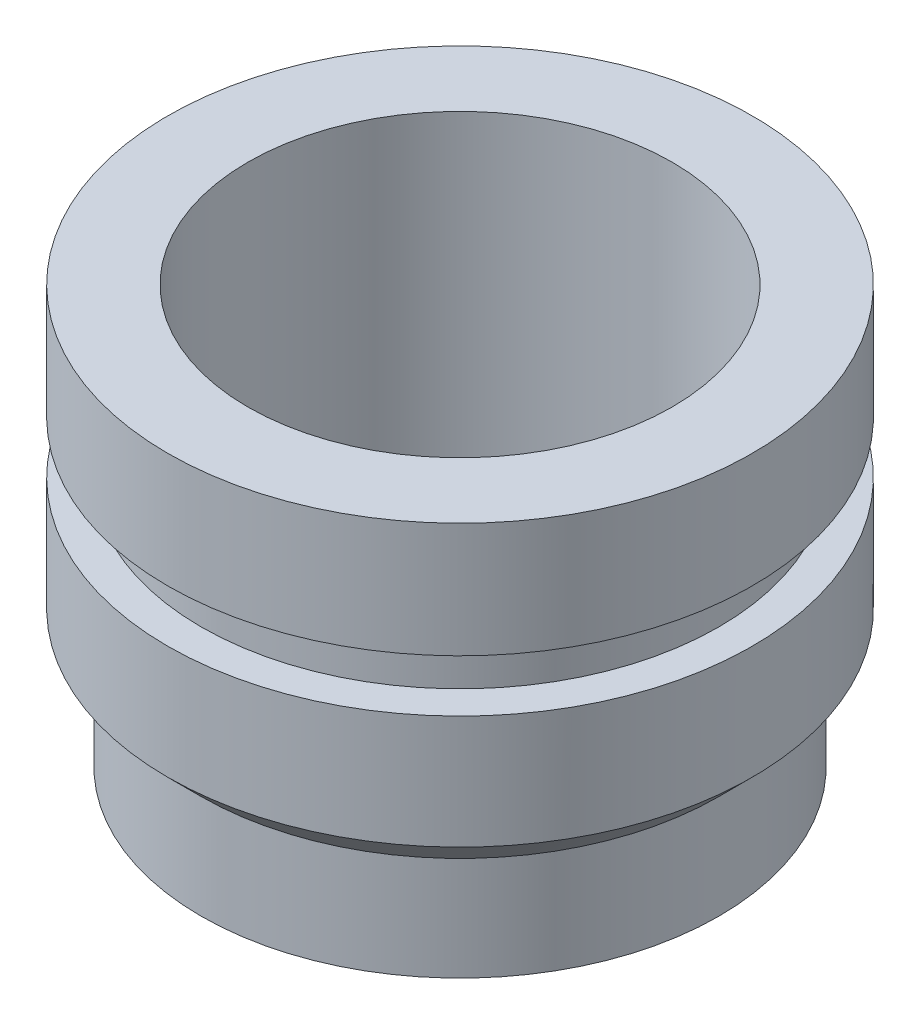
ISO-10303-21;
HEADER;
FILE_DESCRIPTION(('STEP AP214'),'2;1');
FILE_NAME('part.step','',(''),(''),'','','');
FILE_SCHEMA(('AUTOMOTIVE_DESIGN { 1 0 10303 214 1 1 1 1 }'));
ENDSEC;
DATA;
#1=APPLICATION_CONTEXT('core data for automotive mechanical design processes');
#2=APPLICATION_PROTOCOL_DEFINITION('international standard','automotive_design',2000,#1);
#3=PRODUCT_CONTEXT('',#1,'mechanical');
#4=PRODUCT('Part','Part','',(#3));
#5=PRODUCT_RELATED_PRODUCT_CATEGORY('part','',(#4));
#6=PRODUCT_DEFINITION_FORMATION('','',#4);
#7=PRODUCT_DEFINITION_CONTEXT('part definition',#1,'design');
#8=PRODUCT_DEFINITION('design','',#6,#7);
#9=PRODUCT_DEFINITION_SHAPE('','',#8);
#10=(LENGTH_UNIT() NAMED_UNIT(*) SI_UNIT(.MILLI.,.METRE.));
#11=(NAMED_UNIT(*) PLANE_ANGLE_UNIT() SI_UNIT($,.RADIAN.));
#12=(NAMED_UNIT(*) SI_UNIT($,.STERADIAN.) SOLID_ANGLE_UNIT());
#13=UNCERTAINTY_MEASURE_WITH_UNIT(LENGTH_MEASURE(1.E-05),#10,'distance_accuracy_value','');
#14=(GEOMETRIC_REPRESENTATION_CONTEXT(3) GLOBAL_UNCERTAINTY_ASSIGNED_CONTEXT((#13)) GLOBAL_UNIT_ASSIGNED_CONTEXT((#10,
#11,#12)) REPRESENTATION_CONTEXT('',''));
#15=CARTESIAN_POINT('',(0.,0.,0.));
#16=DIRECTION('',(0.,0.,1.));
#17=DIRECTION('',(1.,0.,0.));
#18=AXIS2_PLACEMENT_3D('',#15,#16,#17);
#19=CARTESIAN_POINT('',(0.,-2.50000008,0.));
#20=DIRECTION('',(0.,1.,0.));
#21=DIRECTION('',(0.,0.,1.));
#22=AXIS2_PLACEMENT_3D('',#19,#20,#21);
#23=CYLINDRICAL_SURFACE('',#22,1.750000056);
#24=CARTESIAN_POINT('',(0.,-1.67950007,0.));
#25=DIRECTION('',(0.,-1.,0.));
#26=DIRECTION('',(0.,0.,-1.));
#27=AXIS2_PLACEMENT_3D('',#24,#25,#26);
#28=CIRCLE('',#27,1.750000056);
#29=CARTESIAN_POINT('',(0.,-1.67950007,-1.750000056));
#30=VERTEX_POINT('',#29);
#31=EDGE_CURVE('E54',#30,#30,#28,.F.);
#32=ORIENTED_EDGE('',*,*,#31,.T.);
#33=EDGE_LOOP('',(#32));
#34=FACE_BOUND('',#33,.T.);
#35=CARTESIAN_POINT('',(0.,-1.000000032,0.));
#36=DIRECTION('',(0.,1.,0.));
#37=DIRECTION('',(0.,0.,1.));
#38=AXIS2_PLACEMENT_3D('',#35,#36,#37);
#39=CIRCLE('',#38,1.750000056);
#40=CARTESIAN_POINT('',(0.,-1.000000032,1.750000056));
#41=VERTEX_POINT('',#40);
#42=EDGE_CURVE('E79',#41,#41,#39,.T.);
#43=ORIENTED_EDGE('',*,*,#42,.F.);
#44=EDGE_LOOP('',(#43));
#45=FACE_BOUND('',#44,.T.);
#46=ADVANCED_FACE('F45',(#34,#45),#23,.T.);
#47=CARTESIAN_POINT('',(0.,-0.687500022,0.));
#48=DIRECTION('',(0.,1.,0.));
#49=DIRECTION('',(0.,0.,1.));
#50=AXIS2_PLACEMENT_3D('',#47,#48,#49);
#51=CIRCLE('',#50,1.750000056);
#52=CARTESIAN_POINT('',(0.,-0.687500022,1.750000056));
#53=VERTEX_POINT('',#52);
#54=EDGE_CURVE('E78',#53,#53,#51,.T.);
#55=ORIENTED_EDGE('',*,*,#54,.T.);
#56=EDGE_LOOP('',(#55));
#57=FACE_BOUND('',#56,.T.);
#58=CARTESIAN_POINT('',(0.,0.,0.));
#59=DIRECTION('',(0.,1.,0.));
#60=DIRECTION('',(0.,0.,1.));
#61=AXIS2_PLACEMENT_3D('',#58,#59,#60);
#62=CIRCLE('',#61,1.750000056);
#63=CARTESIAN_POINT('',(0.,0.,1.750000056));
#64=VERTEX_POINT('',#63);
#65=EDGE_CURVE('E59',#64,#64,#62,.T.);
#66=ORIENTED_EDGE('',*,*,#65,.F.);
#67=EDGE_LOOP('',(#66));
#68=FACE_BOUND('',#67,.T.);
#69=ADVANCED_FACE('F114',(#57,#68),#23,.T.);
#70=CARTESIAN_POINT('',(0.,-2.50000008,0.));
#71=DIRECTION('',(0.,1.,0.));
#72=DIRECTION('',(0.,0.,1.));
#73=AXIS2_PLACEMENT_3D('',#70,#71,#72);
#74=PLANE('',#73);
#75=CARTESIAN_POINT('',(0.,-2.50000008,0.));
#76=DIRECTION('',(0.,1.,0.));
#77=DIRECTION('',(0.,0.,1.));
#78=AXIS2_PLACEMENT_3D('',#75,#76,#77);
#79=CIRCLE('',#78,1.27);
#80=CARTESIAN_POINT('',(0.,-2.50000008,1.27));
#81=VERTEX_POINT('',#80);
#82=EDGE_CURVE('E64',#81,#81,#79,.T.);
#83=ORIENTED_EDGE('',*,*,#82,.T.);
#84=EDGE_LOOP('',(#83));
#85=FACE_BOUND('',#84,.T.);
#86=CARTESIAN_POINT('',(0.,-2.50000008,0.));
#87=DIRECTION('',(0.,-1.,0.));
#88=DIRECTION('',(0.,0.,-1.));
#89=AXIS2_PLACEMENT_3D('',#86,#87,#88);
#90=CIRCLE('',#89,1.549999948);
#91=CARTESIAN_POINT('',(0.,-2.50000008,-1.549999948));
#92=VERTEX_POINT('',#91);
#93=EDGE_CURVE('E71',#92,#92,#90,.T.);
#94=ORIENTED_EDGE('',*,*,#93,.T.);
#95=EDGE_LOOP('',(#94));
#96=FACE_BOUND('',#95,.T.);
#97=ADVANCED_FACE('F119',(#85,#96),#74,.F.);
#98=CARTESIAN_POINT('',(0.,0.,0.));
#99=DIRECTION('',(0.,1.,0.));
#100=DIRECTION('',(0.,0.,1.));
#101=AXIS2_PLACEMENT_3D('',#98,#99,#100);
#102=PLANE('',#101);
#103=CARTESIAN_POINT('',(0.,0.,0.));
#104=DIRECTION('',(0.,1.,0.));
#105=DIRECTION('',(0.,0.,1.));
#106=AXIS2_PLACEMENT_3D('',#103,#104,#105);
#107=CIRCLE('',#106,1.27);
#108=CARTESIAN_POINT('',(0.,0.,1.27));
#109=VERTEX_POINT('',#108);
#110=EDGE_CURVE('E67',#109,#109,#107,.T.);
#111=ORIENTED_EDGE('',*,*,#110,.F.);
#112=EDGE_LOOP('',(#111));
#113=FACE_BOUND('',#112,.T.);
#114=ORIENTED_EDGE('',*,*,#65,.T.);
#115=EDGE_LOOP('',(#114));
#116=FACE_BOUND('',#115,.T.);
#117=ADVANCED_FACE('F123',(#113,#116),#102,.T.);
#118=CARTESIAN_POINT('',(0.,-2.50000008,0.));
#119=DIRECTION('',(0.,1.,0.));
#120=DIRECTION('',(0.,0.,1.));
#121=AXIS2_PLACEMENT_3D('',#118,#119,#120);
#122=CYLINDRICAL_SURFACE('',#121,1.27);
#123=ORIENTED_EDGE('',*,*,#82,.F.);
#124=EDGE_LOOP('',(#123));
#125=FACE_BOUND('',#124,.T.);
#126=ORIENTED_EDGE('',*,*,#110,.T.);
#127=EDGE_LOOP('',(#126));
#128=FACE_BOUND('',#127,.T.);
#129=ADVANCED_FACE('F126',(#125,#128),#122,.F.);
#130=CARTESIAN_POINT('',(0.,-2.18750007,0.));
#131=DIRECTION('',(0.,-1.,0.));
#132=DIRECTION('',(0.,0.,-1.));
#133=AXIS2_PLACEMENT_3D('',#130,#131,#132);
#134=CYLINDRICAL_SURFACE('',#133,1.549999948);
#135=CARTESIAN_POINT('',(0.,-1.87950017799999,0.));
#136=DIRECTION('',(0.,1.,0.));
#137=DIRECTION('',(0.,0.,1.));
#138=AXIS2_PLACEMENT_3D('',#135,#136,#137);
#139=CIRCLE('',#138,1.549999948);
#140=CARTESIAN_POINT('',(0.,-1.87950017799999,1.549999948));
#141=VERTEX_POINT('',#140);
#142=EDGE_CURVE('E10',#141,#141,#139,.F.);
#143=ORIENTED_EDGE('',*,*,#142,.T.);
#144=EDGE_LOOP('',(#143));
#145=FACE_BOUND('',#144,.T.);
#146=ORIENTED_EDGE('',*,*,#93,.F.);
#147=EDGE_LOOP('',(#146));
#148=FACE_BOUND('',#147,.T.);
#149=ADVANCED_FACE('F132',(#145,#148),#134,.T.);
#150=CARTESIAN_POINT('',(0.,-2.18750007,0.));
#151=DIRECTION('',(0.,1.,0.));
#152=DIRECTION('',(0.,0.,1.));
#153=AXIS2_PLACEMENT_3D('',#150,#151,#152);
#154=CONICAL_SURFACE('',#153,1.24200005599999,0.785398163397453);
#155=ORIENTED_EDGE('',*,*,#31,.F.);
#156=EDGE_LOOP('',(#155));
#157=FACE_BOUND('',#156,.T.);
#158=ORIENTED_EDGE('',*,*,#142,.F.);
#159=EDGE_LOOP('',(#158));
#160=FACE_BOUND('',#159,.T.);
#161=ADVANCED_FACE('F48',(#157,#160),#154,.T.);
#162=CARTESIAN_POINT('',(0.,-0.687500022,0.));
#163=DIRECTION('',(0.,1.,0.));
#164=DIRECTION('',(0.,0.,1.));
#165=AXIS2_PLACEMENT_3D('',#162,#163,#164);
#166=PLANE('',#165);
#167=ORIENTED_EDGE('',*,*,#54,.F.);
#168=EDGE_LOOP('',(#167));
#169=FACE_BOUND('',#168,.T.);
#170=CARTESIAN_POINT('',(0.,-0.687500022,0.));
#171=DIRECTION('',(0.,1.,0.));
#172=DIRECTION('',(0.,0.,1.));
#173=AXIS2_PLACEMENT_3D('',#170,#171,#172);
#174=CIRCLE('',#173,1.549999948);
#175=CARTESIAN_POINT('',(0.,-0.687500022,1.549999948));
#176=VERTEX_POINT('',#175);
#177=EDGE_CURVE('E83',#176,#176,#174,.T.);
#178=ORIENTED_EDGE('',*,*,#177,.T.);
#179=EDGE_LOOP('',(#178));
#180=FACE_BOUND('',#179,.T.);
#181=ADVANCED_FACE('F95',(#169,#180),#166,.F.);
#182=CARTESIAN_POINT('',(0.,-1.000000032,0.));
#183=DIRECTION('',(0.,1.,0.));
#184=DIRECTION('',(0.,0.,1.));
#185=AXIS2_PLACEMENT_3D('',#182,#183,#184);
#186=PLANE('',#185);
#187=ORIENTED_EDGE('',*,*,#42,.T.);
#188=EDGE_LOOP('',(#187));
#189=FACE_BOUND('',#188,.T.);
#190=CARTESIAN_POINT('',(0.,-1.000000032,0.));
#191=DIRECTION('',(0.,1.,0.));
#192=DIRECTION('',(0.,0.,1.));
#193=AXIS2_PLACEMENT_3D('',#190,#191,#192);
#194=CIRCLE('',#193,1.549999948);
#195=CARTESIAN_POINT('',(0.,-1.000000032,1.549999948));
#196=VERTEX_POINT('',#195);
#197=EDGE_CURVE('E87',#196,#196,#194,.T.);
#198=ORIENTED_EDGE('',*,*,#197,.F.);
#199=EDGE_LOOP('',(#198));
#200=FACE_BOUND('',#199,.T.);
#201=ADVANCED_FACE('F100',(#189,#200),#186,.T.);
#202=CARTESIAN_POINT('',(0.,-0.687500022,0.));
#203=DIRECTION('',(0.,-1.,0.));
#204=DIRECTION('',(0.,0.,-1.));
#205=AXIS2_PLACEMENT_3D('',#202,#203,#204);
#206=CYLINDRICAL_SURFACE('',#205,1.549999948);
#207=ORIENTED_EDGE('',*,*,#177,.F.);
#208=EDGE_LOOP('',(#207));
#209=FACE_BOUND('',#208,.T.);
#210=ORIENTED_EDGE('',*,*,#197,.T.);
#211=EDGE_LOOP('',(#210));
#212=FACE_BOUND('',#211,.T.);
#213=ADVANCED_FACE('F97',(#209,#212),#206,.T.);
#214=CLOSED_SHELL('',(#46,#69,#97,#117,#129,#149,#161,#181,#201,#213));
#215=MANIFOLD_SOLID_BREP('B2',#214);
#216=ADVANCED_BREP_SHAPE_REPRESENTATION('',(#18,#215),#14);
#217=SHAPE_DEFINITION_REPRESENTATION(#9,#216);
ENDSEC;
END-ISO-10303-21;
